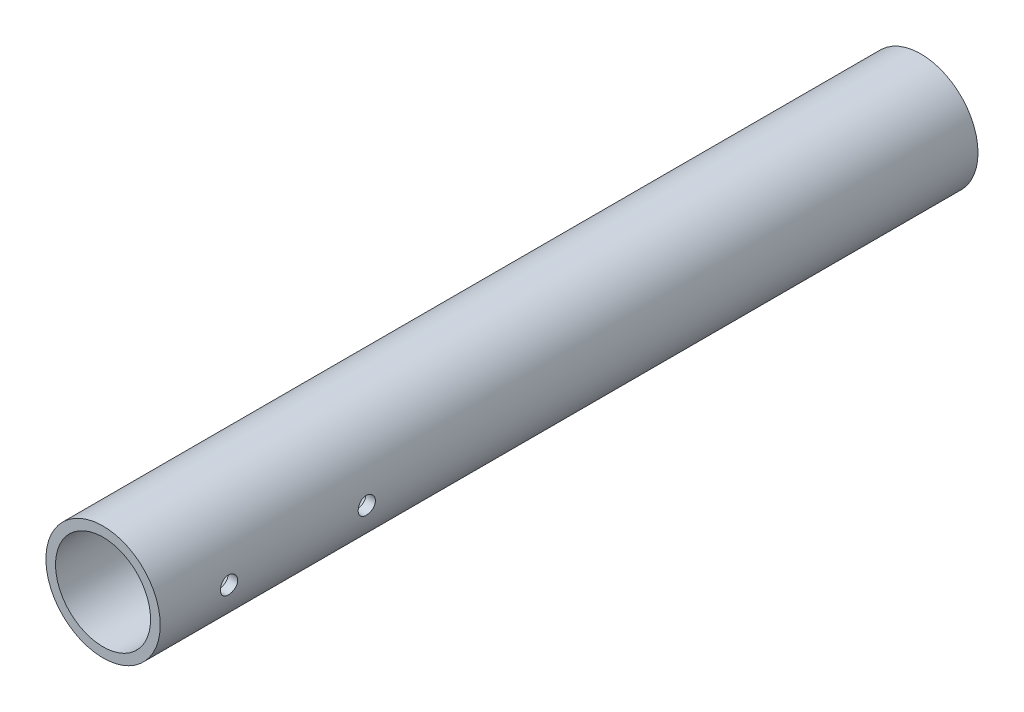
ISO-10303-21;
HEADER;
FILE_DESCRIPTION(('STEP AP214'),'2;1');
FILE_NAME('part.step','',(''),(''),'','','');
FILE_SCHEMA(('AUTOMOTIVE_DESIGN { 1 0 10303 214 1 1 1 1 }'));
ENDSEC;
DATA;
#1=APPLICATION_CONTEXT('core data for automotive mechanical design processes');
#2=APPLICATION_PROTOCOL_DEFINITION('international standard','automotive_design',2000,#1);
#3=PRODUCT_CONTEXT('',#1,'mechanical');
#4=PRODUCT('Part','Part','',(#3));
#5=PRODUCT_RELATED_PRODUCT_CATEGORY('part','',(#4));
#6=PRODUCT_DEFINITION_FORMATION('','',#4);
#7=PRODUCT_DEFINITION_CONTEXT('part definition',#1,'design');
#8=PRODUCT_DEFINITION('design','',#6,#7);
#9=PRODUCT_DEFINITION_SHAPE('','',#8);
#10=(LENGTH_UNIT() NAMED_UNIT(*) SI_UNIT(.MILLI.,.METRE.));
#11=(NAMED_UNIT(*) PLANE_ANGLE_UNIT() SI_UNIT($,.RADIAN.));
#12=(NAMED_UNIT(*) SI_UNIT($,.STERADIAN.) SOLID_ANGLE_UNIT());
#13=UNCERTAINTY_MEASURE_WITH_UNIT(LENGTH_MEASURE(1.E-05),#10,'distance_accuracy_value','');
#14=(GEOMETRIC_REPRESENTATION_CONTEXT(3) GLOBAL_UNCERTAINTY_ASSIGNED_CONTEXT((#13)) GLOBAL_UNIT_ASSIGNED_CONTEXT((#10,
#11,#12)) REPRESENTATION_CONTEXT('',''));
#15=CARTESIAN_POINT('',(0.,0.,0.));
#16=DIRECTION('',(0.,0.,1.));
#17=DIRECTION('',(1.,0.,0.));
#18=AXIS2_PLACEMENT_3D('',#15,#16,#17);
#19=CARTESIAN_POINT('',(0.,0.,0.));
#20=DIRECTION('',(0.,0.,1.));
#21=DIRECTION('',(1.,0.,0.));
#22=AXIS2_PLACEMENT_3D('',#19,#20,#21);
#23=CYLINDRICAL_SURFACE('',#22,17.526);
#24=CARTESIAN_POINT('',(0.,0.,301.625));
#25=DIRECTION('',(0.,0.,1.));
#26=DIRECTION('',(1.,0.,0.));
#27=AXIS2_PLACEMENT_3D('',#24,#25,#26);
#28=CIRCLE('',#27,17.526);
#29=CARTESIAN_POINT('',(17.526,0.,301.625));
#30=VERTEX_POINT('',#29);
#31=EDGE_CURVE('E18',#30,#30,#28,.F.);
#32=ORIENTED_EDGE('',*,*,#31,.F.);
#33=EDGE_LOOP('',(#32));
#34=FACE_BOUND('',#33,.T.);
#35=CARTESIAN_POINT('',(0.,0.,0.));
#36=DIRECTION('',(0.,0.,1.));
#37=DIRECTION('',(1.,0.,0.));
#38=AXIS2_PLACEMENT_3D('',#35,#36,#37);
#39=CIRCLE('',#38,17.526);
#40=CARTESIAN_POINT('',(17.526,0.,0.));
#41=VERTEX_POINT('',#40);
#42=EDGE_CURVE('E78',#41,#41,#39,.F.);
#43=ORIENTED_EDGE('',*,*,#42,.T.);
#44=EDGE_LOOP('',(#43));
#45=FACE_BOUND('',#44,.T.);
#46=CARTESIAN_POINT('',(17.526,0.,228.6));
#47=CARTESIAN_POINT('',(17.5259963175726,-0.176613181051219,228.599991723302));
#48=CARTESIAN_POINT('',(17.5233002826582,-0.353449171258822,228.585200668148));
#49=CARTESIAN_POINT('',(17.5127973362593,-0.702281908474058,228.526423100833));
#50=CARTESIAN_POINT('',(17.5049801575711,-0.874268208471729,228.482377935658));
#51=CARTESIAN_POINT('',(17.48511038614,-1.20810250721724,228.36647464681));
#52=CARTESIAN_POINT('',(17.473063368271,-1.36996352173553,228.294653119444));
#53=CARTESIAN_POINT('',(17.4460554580361,-1.67927316437238,228.125324943954));
#54=CARTESIAN_POINT('',(17.4310956012814,-1.82672688686375,228.027827420172));
#55=CARTESIAN_POINT('',(17.3997238299546,-2.10477719057218,227.808732397024));
#56=CARTESIAN_POINT('',(17.3832987194985,-2.23518750324315,227.686900352404));
#57=CARTESIAN_POINT('',(17.3509459564745,-2.4738411468331,227.42309368207));
#58=CARTESIAN_POINT('',(17.335018364459,-2.58208178835294,227.281116616098));
#59=CARTESIAN_POINT('',(17.3053385875312,-2.77407123838613,226.979766903282));
#60=CARTESIAN_POINT('',(17.2916032051447,-2.85763469507356,226.820274368621));
#61=CARTESIAN_POINT('',(17.2680458993697,-2.99671051245856,226.489226026226));
#62=CARTESIAN_POINT('',(17.2582236283197,-3.05222536525873,226.317671291755));
#63=CARTESIAN_POINT('',(17.2437354897132,-3.13304106760211,225.969333560972));
#64=CARTESIAN_POINT('',(17.2390149777777,-3.15866234519934,225.792627222411));
#65=CARTESIAN_POINT('',(17.2350999262051,-3.17995782709564,225.437365293601));
#66=CARTESIAN_POINT('',(17.2359049331653,-3.17563448853508,225.258809856282));
#67=CARTESIAN_POINT('',(17.2429001543548,-3.1374237379337,224.907230746528));
#68=CARTESIAN_POINT('',(17.2490242048828,-3.10389954139064,224.734166088615));
#69=CARTESIAN_POINT('',(17.2658637551246,-3.00880960849843,224.396157532169));
#70=CARTESIAN_POINT('',(17.276579474651,-2.94724252966899,224.231214022834));
#71=CARTESIAN_POINT('',(17.3014652665684,-2.79745291276664,223.913055892979));
#72=CARTESIAN_POINT('',(17.3156545368537,-2.70908155858375,223.759912899375));
#73=CARTESIAN_POINT('',(17.3458743890737,-2.50830442996258,223.470503775616));
#74=CARTESIAN_POINT('',(17.3619050065012,-2.39589819220294,223.334237970883));
#75=CARTESIAN_POINT('',(17.3942883351767,-2.1482992811474,223.080361728415));
#76=CARTESIAN_POINT('',(17.4106423451863,-2.01279967929527,222.963050627084));
#77=CARTESIAN_POINT('',(17.4416233292778,-1.72381393754222,222.752729015706));
#78=CARTESIAN_POINT('',(17.4562495353168,-1.57031985869495,222.65972929043));
#79=CARTESIAN_POINT('',(17.4821550853628,-1.24935860544025,222.50063859958));
#80=CARTESIAN_POINT('',(17.4934280108005,-1.08186540977742,222.434599150311));
#81=CARTESIAN_POINT('',(17.5112904348231,-0.738132155126084,222.331807400917));
#82=CARTESIAN_POINT('',(17.5178897862262,-0.561911340494511,222.294993467668));
#83=CARTESIAN_POINT('',(17.5231896350432,-0.320322833927912,222.265545032544));
#84=CARTESIAN_POINT('',(17.5242412276541,-0.256410066392401,222.259720466382));
#85=CARTESIAN_POINT('',(17.5256470796399,-0.128341342038199,222.251946444097));
#86=CARTESIAN_POINT('',(17.5260013382808,-0.0641853849635993,222.249996992053));
#87=CARTESIAN_POINT('',(17.5259963175725,0.176613181051216,222.250008276698));
#88=CARTESIAN_POINT('',(17.5233002826582,0.35344917125882,222.264799331852));
#89=CARTESIAN_POINT('',(17.5127973362593,0.702281908474057,222.323576899167));
#90=CARTESIAN_POINT('',(17.5049801575711,0.874268208471726,222.367622064342));
#91=CARTESIAN_POINT('',(17.48511038614,1.20810250721724,222.48352535319));
#92=CARTESIAN_POINT('',(17.473063368271,1.36996352173553,222.555346880556));
#93=CARTESIAN_POINT('',(17.4460554580361,1.67927316437238,222.724675056046));
#94=CARTESIAN_POINT('',(17.4310956012814,1.82672688686375,222.822172579828));
#95=CARTESIAN_POINT('',(17.3997238299546,2.10477719057218,223.041267602976));
#96=CARTESIAN_POINT('',(17.3832987194985,2.23518750324315,223.163099647596));
#97=CARTESIAN_POINT('',(17.3509459564745,2.4738411468331,223.42690631793));
#98=CARTESIAN_POINT('',(17.335018364459,2.58208178835294,223.568883383902));
#99=CARTESIAN_POINT('',(17.3053385875312,2.77407123838613,223.870233096717));
#100=CARTESIAN_POINT('',(17.2916032051447,2.85763469507356,224.029725631379));
#101=CARTESIAN_POINT('',(17.2680458993697,2.99671051245856,224.360773973774));
#102=CARTESIAN_POINT('',(17.2582236283197,3.05222536525873,224.532328708245));
#103=CARTESIAN_POINT('',(17.2437354897132,3.13304106760212,224.880666439028));
#104=CARTESIAN_POINT('',(17.2390149777777,3.15866234519934,225.057372777589));
#105=CARTESIAN_POINT('',(17.2350999262051,3.17995782709564,225.412634706399));
#106=CARTESIAN_POINT('',(17.2359049331653,3.17563448853508,225.591190143718));
#107=CARTESIAN_POINT('',(17.2429001543548,3.1374237379337,225.942769253472));
#108=CARTESIAN_POINT('',(17.2490242048828,3.10389954139064,226.115833911385));
#109=CARTESIAN_POINT('',(17.2658637551246,3.00880960849843,226.453842467831));
#110=CARTESIAN_POINT('',(17.276579474651,2.94724252966899,226.618785977166));
#111=CARTESIAN_POINT('',(17.3014652665683,2.79745291276665,226.936944107021));
#112=CARTESIAN_POINT('',(17.3156545368537,2.70908155858377,227.090087100625));
#113=CARTESIAN_POINT('',(17.3458743890737,2.50830442996262,227.379496224384));
#114=CARTESIAN_POINT('',(17.3619050065012,2.39589819220297,227.515762029117));
#115=CARTESIAN_POINT('',(17.3942883351767,2.14829928114741,227.769638271585));
#116=CARTESIAN_POINT('',(17.4106423451863,2.01279967929527,227.886949372916));
#117=CARTESIAN_POINT('',(17.4416233292778,1.72381393754221,228.097270984294));
#118=CARTESIAN_POINT('',(17.4562495353168,1.57031985869494,228.19027070957));
#119=CARTESIAN_POINT('',(17.4821550853628,1.24935860544024,228.34936140042));
#120=CARTESIAN_POINT('',(17.4934280108005,1.08186540977741,228.415400849689));
#121=CARTESIAN_POINT('',(17.5112904348231,0.738132155126082,228.518192599083));
#122=CARTESIAN_POINT('',(17.5178897862262,0.56191134049451,228.555006532332));
#123=CARTESIAN_POINT('',(17.5231896350432,0.320322833927913,228.584454967456));
#124=CARTESIAN_POINT('',(17.5242412276541,0.256410066392403,228.590279533618));
#125=CARTESIAN_POINT('',(17.5256470796399,0.128341342038199,228.598053555903));
#126=CARTESIAN_POINT('',(17.5260013382808,0.064185384963597,228.600003007947));
#127=CARTESIAN_POINT('',(17.526,0.,228.6));
#128=B_SPLINE_CURVE_WITH_KNOTS('',3,(#46,#47,#48,#49,#50,#51,#52,#53,#54,#55,#56,#57,#58,#59,
#60,#61,#62,#63,#64,#65,#66,#67,#68,#69,#70,#71,#72,#73,#74,#75,#76,#77,#78,#79,#80,#81,#82,#83,
#84,#85,#86,#87,#88,#89,#90,#91,#92,#93,#94,#95,#96,#97,#98,#99,#100,#101,#102,#103,#104,#105,
#106,#107,#108,#109,#110,#111,#112,#113,#114,#115,#116,#117,#118,#119,#120,#121,#122,#123,#124,
#125,#126,#127),.UNSPECIFIED.,.T.,.F.,(4,2,2,2,2,2,2,2,2,2,2,2,2,2,2,2,2,2,2,2,2,2,2,2,2,2,2,2,
2,2,2,2,2,2,2,2,2,2,2,2,4),(0.,0.529594384353563,1.06025379692028,1.59021641642846,
2.11999095947089,2.65514211392808,3.19035814908344,3.72949754433928,4.26858902893713,
4.80184732449043,5.33506186343175,5.86173721299806,6.38843777843187,6.91811781643,
7.44780806601112,7.98518312810166,8.52279617220151,9.06143174460419,9.59892835876538,
9.79139521459188,9.98386227300716,10.5134566573607,11.0441160699274,11.5740786894356,
12.103853232478,12.6390043869352,13.1742204220906,13.7133598173464,14.2524513019443,
14.7857095974976,15.3189241364389,15.8455994860052,16.372300051439,16.9019800894371,
17.4316703390183,17.9690454011088,18.5066584452087,19.0452940176114,19.5827906317725,
19.775257487599,19.9677245460143),.UNSPECIFIED.);
#129=CARTESIAN_POINT('',(17.526,0.,228.6));
#130=VERTEX_POINT('',#129);
#131=EDGE_CURVE('E72',#130,#130,#128,.T.);
#132=ORIENTED_EDGE('',*,*,#131,.T.);
#133=EDGE_LOOP('',(#132));
#134=FACE_BOUND('',#133,.T.);
#135=CARTESIAN_POINT('',(17.526,0.,279.4));
#136=CARTESIAN_POINT('',(17.5259963175726,-0.176613181051217,279.399991723302));
#137=CARTESIAN_POINT('',(17.5233002826582,-0.353449171258817,279.385200668148));
#138=CARTESIAN_POINT('',(17.5127973362593,-0.702281908474051,279.326423100833));
#139=CARTESIAN_POINT('',(17.5049801575711,-0.874268208471723,279.282377935658));
#140=CARTESIAN_POINT('',(17.48511038614,-1.20810250721723,279.16647464681));
#141=CARTESIAN_POINT('',(17.473063368271,-1.36996352173552,279.094653119444));
#142=CARTESIAN_POINT('',(17.4460554580361,-1.67927316437237,278.925324943954));
#143=CARTESIAN_POINT('',(17.4310956012814,-1.82672688686375,278.827827420172));
#144=CARTESIAN_POINT('',(17.3997238299546,-2.10477719057218,278.608732397024));
#145=CARTESIAN_POINT('',(17.3832987194985,-2.23518750324315,278.486900352404));
#146=CARTESIAN_POINT('',(17.3509459564745,-2.4738411468331,278.22309368207));
#147=CARTESIAN_POINT('',(17.335018364459,-2.58208178835293,278.081116616098));
#148=CARTESIAN_POINT('',(17.3053385875312,-2.77407123838613,277.779766903283));
#149=CARTESIAN_POINT('',(17.2916032051447,-2.85763469507356,277.620274368621));
#150=CARTESIAN_POINT('',(17.2680458993697,-2.99671051245855,277.289226026226));
#151=CARTESIAN_POINT('',(17.2582236283197,-3.05222536525872,277.117671291755));
#152=CARTESIAN_POINT('',(17.2437354897132,-3.13304106760211,276.769333560972));
#153=CARTESIAN_POINT('',(17.2390149777777,-3.15866234519934,276.592627222411));
#154=CARTESIAN_POINT('',(17.2350999262051,-3.17995782709565,276.237365293601));
#155=CARTESIAN_POINT('',(17.2359049331653,-3.17563448853508,276.058809856282));
#156=CARTESIAN_POINT('',(17.2429001543548,-3.13742373793371,275.707230746528));
#157=CARTESIAN_POINT('',(17.2490242048828,-3.10389954139064,275.534166088615));
#158=CARTESIAN_POINT('',(17.2658637551246,-3.00880960849844,275.196157532169));
#159=CARTESIAN_POINT('',(17.276579474651,-2.947242529669,275.031214022834));
#160=CARTESIAN_POINT('',(17.3014652665683,-2.79745291276668,274.713055892979));
#161=CARTESIAN_POINT('',(17.3156545368537,-2.70908155858381,274.559912899375));
#162=CARTESIAN_POINT('',(17.3458743890737,-2.50830442996264,274.270503775616));
#163=CARTESIAN_POINT('',(17.3619050065012,-2.39589819220297,274.134237970883));
#164=CARTESIAN_POINT('',(17.3942883351767,-2.14829928114741,273.880361728415));
#165=CARTESIAN_POINT('',(17.4106423451863,-2.01279967929529,273.763050627084));
#166=CARTESIAN_POINT('',(17.4416233292778,-1.72381393754225,273.552729015706));
#167=CARTESIAN_POINT('',(17.4562495353167,-1.57031985869497,273.45972929043));
#168=CARTESIAN_POINT('',(17.4821550853627,-1.24935860544027,273.30063859958));
#169=CARTESIAN_POINT('',(17.4934280108005,-1.08186540977745,273.234599150311));
#170=CARTESIAN_POINT('',(17.5112904348231,-0.738132155126105,273.131807400917));
#171=CARTESIAN_POINT('',(17.5178897862262,-0.561911340494518,273.094993467668));
#172=CARTESIAN_POINT('',(17.5231896350432,-0.320322833927917,273.065545032544));
#173=CARTESIAN_POINT('',(17.5242412276541,-0.256410066392408,273.059720466382));
#174=CARTESIAN_POINT('',(17.5256470796399,-0.128341342038205,273.051946444097));
#175=CARTESIAN_POINT('',(17.5260013382808,-0.0641853849636042,273.049996992053));
#176=CARTESIAN_POINT('',(17.5259963175725,0.176613181051215,273.050008276698));
#177=CARTESIAN_POINT('',(17.5233002826582,0.353449171258822,273.064799331852));
#178=CARTESIAN_POINT('',(17.5127973362593,0.702281908474058,273.123576899167));
#179=CARTESIAN_POINT('',(17.5049801575711,0.874268208471724,273.167622064342));
#180=CARTESIAN_POINT('',(17.48511038614,1.20810250721723,273.28352535319));
#181=CARTESIAN_POINT('',(17.473063368271,1.36996352173552,273.355346880556));
#182=CARTESIAN_POINT('',(17.4460554580361,1.67927316437237,273.524675056046));
#183=CARTESIAN_POINT('',(17.4310956012814,1.82672688686375,273.622172579828));
#184=CARTESIAN_POINT('',(17.3997238299546,2.10477719057218,273.841267602976));
#185=CARTESIAN_POINT('',(17.3832987194985,2.23518750324315,273.963099647596));
#186=CARTESIAN_POINT('',(17.3509459564745,2.4738411468331,274.22690631793));
#187=CARTESIAN_POINT('',(17.335018364459,2.58208178835293,274.368883383902));
#188=CARTESIAN_POINT('',(17.3053385875312,2.77407123838613,274.670233096717));
#189=CARTESIAN_POINT('',(17.2916032051447,2.85763469507356,274.829725631379));
#190=CARTESIAN_POINT('',(17.2680458993697,2.99671051245855,275.160773973774));
#191=CARTESIAN_POINT('',(17.2582236283197,3.05222536525872,275.332328708245));
#192=CARTESIAN_POINT('',(17.2437354897132,3.13304106760211,275.680666439028));
#193=CARTESIAN_POINT('',(17.2390149777777,3.15866234519934,275.857372777589));
#194=CARTESIAN_POINT('',(17.2350999262051,3.17995782709565,276.212634706399));
#195=CARTESIAN_POINT('',(17.2359049331653,3.17563448853508,276.391190143718));
#196=CARTESIAN_POINT('',(17.2429001543548,3.13742373793371,276.742769253472));
#197=CARTESIAN_POINT('',(17.2490242048828,3.10389954139064,276.915833911385));
#198=CARTESIAN_POINT('',(17.2658637551246,3.00880960849844,277.253842467831));
#199=CARTESIAN_POINT('',(17.276579474651,2.947242529669,277.418785977166));
#200=CARTESIAN_POINT('',(17.3014652665683,2.79745291276668,277.736944107021));
#201=CARTESIAN_POINT('',(17.3156545368537,2.70908155858381,277.890087100625));
#202=CARTESIAN_POINT('',(17.3458743890737,2.50830442996264,278.179496224384));
#203=CARTESIAN_POINT('',(17.3619050065012,2.39589819220297,278.315762029117));
#204=CARTESIAN_POINT('',(17.3942883351767,2.14829928114741,278.569638271585));
#205=CARTESIAN_POINT('',(17.4106423451863,2.01279967929529,278.686949372916));
#206=CARTESIAN_POINT('',(17.4416233292778,1.72381393754225,278.897270984294));
#207=CARTESIAN_POINT('',(17.4562495353167,1.57031985869498,278.99027070957));
#208=CARTESIAN_POINT('',(17.4821550853627,1.24935860544028,279.14936140042));
#209=CARTESIAN_POINT('',(17.4934280108005,1.08186540977744,279.215400849689));
#210=CARTESIAN_POINT('',(17.5112904348231,0.738132155126103,279.318192599083));
#211=CARTESIAN_POINT('',(17.5178897862262,0.561911340494523,279.355006532332));
#212=CARTESIAN_POINT('',(17.5231896350432,0.320322833927918,279.384454967456));
#213=CARTESIAN_POINT('',(17.5242412276541,0.256410066392406,279.390279533618));
#214=CARTESIAN_POINT('',(17.5256470796399,0.1283413420382,279.398053555903));
#215=CARTESIAN_POINT('',(17.5260013382808,0.0641853849635972,279.400003007947));
#216=CARTESIAN_POINT('',(17.526,0.,279.4));
#217=B_SPLINE_CURVE_WITH_KNOTS('',3,(#135,#136,#137,#138,#139,#140,#141,#142,#143,#144,#145,
#146,#147,#148,#149,#150,#151,#152,#153,#154,#155,#156,#157,#158,#159,#160,#161,#162,#163,#164,
#165,#166,#167,#168,#169,#170,#171,#172,#173,#174,#175,#176,#177,#178,#179,#180,#181,#182,#183,
#184,#185,#186,#187,#188,#189,#190,#191,#192,#193,#194,#195,#196,#197,#198,#199,#200,#201,#202,
#203,#204,#205,#206,#207,#208,#209,#210,#211,#212,#213,#214,#215,#216),.UNSPECIFIED.,.T.,.F.,(4,
2,2,2,2,2,2,2,2,2,2,2,2,2,2,2,2,2,2,2,2,2,2,2,2,2,2,2,2,2,2,2,2,2,2,2,2,2,2,2,4),(0.,
0.529594384353553,1.06025379692027,1.59021641642847,2.11999095947089,2.6551421139281,
3.19035814908337,3.72949754433927,4.26858902893715,4.80184732449042,5.33506186343168,
5.86173721299802,6.38843777843179,6.91811781642991,7.44780806601106,7.98518312810164,
8.52279617220147,9.06143174460417,9.59892835876537,9.79139521459187,9.98386227300715,
10.5134566573607,11.0441160699274,11.5740786894356,12.103853232478,12.6390043869353,
13.1742204220905,13.7133598173464,14.2524513019443,14.7857095974976,15.3189241364388,
15.8455994860052,16.372300051439,16.9019800894371,17.4316703390182,17.9690454011088,
18.5066584452086,19.0452940176113,19.5827906317725,19.775257487599,19.9677245460143),.UNSPECIFIED.);
#218=CARTESIAN_POINT('',(17.526,0.,279.4));
#219=VERTEX_POINT('',#218);
#220=EDGE_CURVE('E77',#219,#219,#217,.T.);
#221=ORIENTED_EDGE('',*,*,#220,.T.);
#222=EDGE_LOOP('',(#221));
#223=FACE_BOUND('',#222,.T.);
#224=ADVANCED_FACE('F14',(#34,#45,#134,#223),#23,.F.);
#225=CARTESIAN_POINT('',(0.,0.,301.625));
#226=DIRECTION('',(0.,0.,1.));
#227=DIRECTION('',(1.,0.,0.));
#228=AXIS2_PLACEMENT_3D('',#225,#226,#227);
#229=PLANE('',#228);
#230=ORIENTED_EDGE('',*,*,#31,.T.);
#231=EDGE_LOOP('',(#230));
#232=FACE_BOUND('',#231,.T.);
#233=CARTESIAN_POINT('',(0.,0.,301.625));
#234=DIRECTION('',(0.,0.,1.));
#235=DIRECTION('',(1.,0.,0.));
#236=AXIS2_PLACEMENT_3D('',#233,#234,#235);
#237=CIRCLE('',#236,21.082);
#238=CARTESIAN_POINT('',(21.082,0.,301.625));
#239=VERTEX_POINT('',#238);
#240=EDGE_CURVE('E53',#239,#239,#237,.F.);
#241=ORIENTED_EDGE('',*,*,#240,.F.);
#242=EDGE_LOOP('',(#241));
#243=FACE_BOUND('',#242,.T.);
#244=ADVANCED_FACE('F65',(#232,#243),#229,.T.);
#245=CARTESIAN_POINT('',(0.,0.,0.));
#246=DIRECTION('',(0.,0.,1.));
#247=DIRECTION('',(1.,0.,0.));
#248=AXIS2_PLACEMENT_3D('',#245,#246,#247);
#249=PLANE('',#248);
#250=ORIENTED_EDGE('',*,*,#42,.F.);
#251=EDGE_LOOP('',(#250));
#252=FACE_BOUND('',#251,.T.);
#253=CARTESIAN_POINT('',(0.,0.,0.));
#254=DIRECTION('',(0.,0.,1.));
#255=DIRECTION('',(1.,0.,0.));
#256=AXIS2_PLACEMENT_3D('',#253,#254,#255);
#257=CIRCLE('',#256,21.082);
#258=CARTESIAN_POINT('',(21.082,0.,0.));
#259=VERTEX_POINT('',#258);
#260=EDGE_CURVE('E27',#259,#259,#257,.T.);
#261=ORIENTED_EDGE('',*,*,#260,.F.);
#262=EDGE_LOOP('',(#261));
#263=FACE_BOUND('',#262,.T.);
#264=ADVANCED_FACE('F60',(#252,#263),#249,.F.);
#265=CARTESIAN_POINT('',(0.,0.,225.425));
#266=DIRECTION('',(1.,0.,0.));
#267=DIRECTION('',(0.,0.,-1.));
#268=AXIS2_PLACEMENT_3D('',#265,#266,#267);
#269=CYLINDRICAL_SURFACE('',#268,3.175);
#270=ORIENTED_EDGE('',*,*,#131,.F.);
#271=EDGE_LOOP('',(#270));
#272=FACE_BOUND('',#271,.T.);
#273=CARTESIAN_POINT('',(21.082,0.,222.25));
#274=CARTESIAN_POINT('',(21.08199697693,-0.177096882326681,222.250008010368));
#275=CARTESIAN_POINT('',(21.0797432371457,-0.354422246181486,222.26487962863));
#276=CARTESIAN_POINT('',(21.0709639947796,-0.704244999090061,222.323992357156));
#277=CARTESIAN_POINT('',(21.0644297330762,-0.876731730624422,222.368293691309));
#278=CARTESIAN_POINT('',(21.0478236267626,-1.21157212719879,222.484916576821));
#279=CARTESIAN_POINT('',(21.0377559284511,-1.37393740737855,222.557205296689));
#280=CARTESIAN_POINT('',(21.0151978427835,-1.68416250683157,222.727677911167));
#281=CARTESIAN_POINT('',(21.0027084021292,-1.83202796044268,222.825851692226));
#282=CARTESIAN_POINT('',(20.9765823177096,-2.11031247055376,223.046151374218));
#283=CARTESIAN_POINT('',(20.9629381187472,-2.24059940402081,223.168443308759));
#284=CARTESIAN_POINT('',(20.9360989041358,-2.4788913097797,223.43315612125));
#285=CARTESIAN_POINT('',(20.9229039374157,-2.58689386136821,223.57557918317));
#286=CARTESIAN_POINT('',(20.8983859370743,-2.77804880392724,223.877379318754));
#287=CARTESIAN_POINT('',(20.8870724896658,-2.86107558124535,224.03683680048));
#288=CARTESIAN_POINT('',(20.8676999734321,-2.99911832257812,224.367631067207));
#289=CARTESIAN_POINT('',(20.8596406975045,-3.05413606920678,224.538967095418));
#290=CARTESIAN_POINT('',(20.8477621063255,-3.13419546665349,224.887286214704));
#291=CARTESIAN_POINT('',(20.8439112642446,-3.15946012056009,225.064216954801));
#292=CARTESIAN_POINT('',(20.8407898414214,-3.17998700169885,225.419845640065));
#293=CARTESIAN_POINT('',(20.8415190033561,-3.17525091449293,225.598543485386));
#294=CARTESIAN_POINT('',(20.8474463650272,-3.13609305999255,225.951055967361));
#295=CARTESIAN_POINT('',(20.8526071214054,-3.10192000349508,226.124898951723));
#296=CARTESIAN_POINT('',(20.8667577563942,-3.00524711666564,226.464356569077));
#297=CARTESIAN_POINT('',(20.8757477764901,-2.94274623965999,226.62997089778));
#298=CARTESIAN_POINT('',(20.8965856584325,-2.79093104974241,226.949029881479));
#299=CARTESIAN_POINT('',(20.9084447970673,-2.70151058452644,227.102423259963));
#300=CARTESIAN_POINT('',(20.9336753486097,-2.49847766149162,227.392109939396));
#301=CARTESIAN_POINT('',(20.9470467424824,-2.3848655081586,227.528403455536));
#302=CARTESIAN_POINT('',(20.9739588701191,-2.13533197536228,227.781452795665));
#303=CARTESIAN_POINT('',(20.9874999699534,-1.99920089823695,227.89800187002));
#304=CARTESIAN_POINT('',(21.0131093792406,-1.70912894954015,228.106684321995));
#305=CARTESIAN_POINT('',(21.0251770223332,-1.55518008085437,228.198806674708));
#306=CARTESIAN_POINT('',(21.0464937025039,-1.23362225418931,228.356023003482));
#307=CARTESIAN_POINT('',(21.0557387492241,-1.06599437803163,228.421078761652));
#308=CARTESIAN_POINT('',(21.0703231912675,-0.722245530020102,228.521925293116));
#309=CARTESIAN_POINT('',(21.0756708320201,-0.546143333577576,228.557777868268));
#310=CARTESIAN_POINT('',(21.0798495375515,-0.307328662833132,228.585693304996));
#311=CARTESIAN_POINT('',(21.0806542771979,-0.245995981253088,228.591054107026));
#312=CARTESIAN_POINT('',(21.0817300341182,-0.12311807286592,228.598208848164));
#313=CARTESIAN_POINT('',(21.0820010510576,-0.0615728459255779,228.600002785036));
#314=CARTESIAN_POINT('',(21.08199697693,0.177096882326674,228.599991989632));
#315=CARTESIAN_POINT('',(21.0797432371457,0.354422246181477,228.58512037137));
#316=CARTESIAN_POINT('',(21.0709639947796,0.704244999090053,228.526007642844));
#317=CARTESIAN_POINT('',(21.0644297330762,0.876731730624415,228.481706308691));
#318=CARTESIAN_POINT('',(21.0478236267626,1.21157212719878,228.365083423179));
#319=CARTESIAN_POINT('',(21.0377559284511,1.37393740737854,228.292794703311));
#320=CARTESIAN_POINT('',(21.0151978427835,1.68416250683156,228.122322088833));
#321=CARTESIAN_POINT('',(21.0027084021292,1.83202796044268,228.024148307774));
#322=CARTESIAN_POINT('',(20.9765823177096,2.11031247055375,227.803848625782));
#323=CARTESIAN_POINT('',(20.9629381187472,2.2405994040208,227.681556691241));
#324=CARTESIAN_POINT('',(20.9360989041358,2.47889130977969,227.41684387875));
#325=CARTESIAN_POINT('',(20.9229039374157,2.5868938613682,227.27442081683));
#326=CARTESIAN_POINT('',(20.8983859370743,2.77804880392722,226.972620681246));
#327=CARTESIAN_POINT('',(20.8870724896658,2.86107558124534,226.81316319952));
#328=CARTESIAN_POINT('',(20.8676999734321,2.99911832257811,226.482368932793));
#329=CARTESIAN_POINT('',(20.8596406975045,3.05413606920678,226.311032904582));
#330=CARTESIAN_POINT('',(20.8477621063255,3.13419546665349,225.962713785296));
#331=CARTESIAN_POINT('',(20.8439112642446,3.15946012056009,225.785783045199));
#332=CARTESIAN_POINT('',(20.8407898414214,3.17998700169885,225.430154359935));
#333=CARTESIAN_POINT('',(20.8415190033561,3.17525091449293,225.251456514614));
#334=CARTESIAN_POINT('',(20.8474463650272,3.13609305999255,224.898944032639));
#335=CARTESIAN_POINT('',(20.8526071214054,3.10192000349508,224.725101048277));
#336=CARTESIAN_POINT('',(20.8667577563942,3.00524711666564,224.385643430923));
#337=CARTESIAN_POINT('',(20.8757477764901,2.94274623965999,224.22002910222));
#338=CARTESIAN_POINT('',(20.8965856584325,2.79093104974241,223.900970118521));
#339=CARTESIAN_POINT('',(20.9084447970673,2.70151058452644,223.747576740037));
#340=CARTESIAN_POINT('',(20.9336753486097,2.49847766149162,223.457890060604));
#341=CARTESIAN_POINT('',(20.9470467424824,2.3848655081586,223.321596544464));
#342=CARTESIAN_POINT('',(20.9739588701191,2.13533197536228,223.068547204335));
#343=CARTESIAN_POINT('',(20.9874999699534,1.99920089823695,222.95199812998));
#344=CARTESIAN_POINT('',(21.0131093792406,1.70912894954015,222.743315678005));
#345=CARTESIAN_POINT('',(21.0251770223332,1.55518008085437,222.651193325292));
#346=CARTESIAN_POINT('',(21.0464937025039,1.23362225418931,222.493976996518));
#347=CARTESIAN_POINT('',(21.0557387492241,1.06599437803164,222.428921238348));
#348=CARTESIAN_POINT('',(21.0703231912675,0.722245530020105,222.328074706884));
#349=CARTESIAN_POINT('',(21.0756708320201,0.546143333577579,222.292222131732));
#350=CARTESIAN_POINT('',(21.0798495375515,0.307328662833134,222.264306695004));
#351=CARTESIAN_POINT('',(21.0806542771979,0.245995981253089,222.258945892974));
#352=CARTESIAN_POINT('',(21.0817300341182,0.123118072865919,222.251791151836));
#353=CARTESIAN_POINT('',(21.0820010510576,0.0615728459255757,222.249997214964));
#354=CARTESIAN_POINT('',(21.082,0.,222.25));
#355=B_SPLINE_CURVE_WITH_KNOTS('',3,(#273,#274,#275,#276,#277,#278,#279,#280,#281,#282,#283,
#284,#285,#286,#287,#288,#289,#290,#291,#292,#293,#294,#295,#296,#297,#298,#299,#300,#301,#302,
#303,#304,#305,#306,#307,#308,#309,#310,#311,#312,#313,#314,#315,#316,#317,#318,#319,#320,#321,
#322,#323,#324,#325,#326,#327,#328,#329,#330,#331,#332,#333,#334,#335,#336,#337,#338,#339,#340,
#341,#342,#343,#344,#345,#346,#347,#348,#349,#350,#351,#352,#353,#354),.UNSPECIFIED.,.T.,.F.,(4,
2,2,2,2,2,2,2,2,2,2,2,2,2,2,2,2,2,2,2,2,2,2,2,2,2,2,2,2,2,2,2,2,2,2,2,2,2,2,2,4),(0.,
0.531055777943665,1.0632016503941,1.59472515452003,2.12604129410148,2.66115151001705,
3.19631982321002,3.73413637351617,4.27191869060599,4.80564407774994,5.33933947832749,
5.86856946465913,6.39781900689902,6.92918350732539,7.46054132019028,7.99715881916553,
8.53401810770141,9.07163288703761,9.60810694982832,9.79274371285329,9.97738059162621,
10.5084363695699,11.0405822420203,11.5721057461462,12.1034218857277,12.6385321016433,
13.1737004148362,13.7115169651423,14.2492992822322,14.7830246693762,15.3167200699537,
15.8459500562853,16.3751995985252,16.9065640989516,17.4379219118165,17.9745394107917,
18.5113986993276,19.0490134786638,19.5854875414545,19.7701243044795,19.9547611832524),.UNSPECIFIED.);
#356=CARTESIAN_POINT('',(21.082,0.,222.25));
#357=VERTEX_POINT('',#356);
#358=EDGE_CURVE('E22',#357,#357,#355,.T.);
#359=ORIENTED_EDGE('',*,*,#358,.F.);
#360=EDGE_LOOP('',(#359));
#361=FACE_BOUND('',#360,.T.);
#362=ADVANCED_FACE('F48',(#272,#361),#269,.F.);
#363=CARTESIAN_POINT('',(0.,0.,276.225));
#364=DIRECTION('',(1.,0.,0.));
#365=DIRECTION('',(0.,0.,-1.));
#366=AXIS2_PLACEMENT_3D('',#363,#364,#365);
#367=CYLINDRICAL_SURFACE('',#366,3.175);
#368=ORIENTED_EDGE('',*,*,#220,.F.);
#369=EDGE_LOOP('',(#368));
#370=FACE_BOUND('',#369,.T.);
#371=CARTESIAN_POINT('',(21.082,0.,273.05));
#372=CARTESIAN_POINT('',(21.08199697693,-0.17709688232668,273.050008010368));
#373=CARTESIAN_POINT('',(21.0797432371457,-0.354422246181484,273.06487962863));
#374=CARTESIAN_POINT('',(21.0709639947796,-0.704244999090057,273.123992357156));
#375=CARTESIAN_POINT('',(21.0644297330762,-0.876731730624416,273.168293691309));
#376=CARTESIAN_POINT('',(21.0478236267626,-1.21157212719878,273.284916576821));
#377=CARTESIAN_POINT('',(21.0377559284511,-1.37393740737854,273.357205296689));
#378=CARTESIAN_POINT('',(21.0151978427835,-1.68416250683155,273.527677911167));
#379=CARTESIAN_POINT('',(21.0027084021292,-1.83202796044267,273.625851692226));
#380=CARTESIAN_POINT('',(20.9765823177096,-2.11031247055373,273.846151374218));
#381=CARTESIAN_POINT('',(20.9629381187472,-2.24059940402077,273.968443308759));
#382=CARTESIAN_POINT('',(20.9360989041358,-2.47889130977967,274.23315612125));
#383=CARTESIAN_POINT('',(20.9229039374157,-2.58689386136818,274.37557918317));
#384=CARTESIAN_POINT('',(20.8983859370743,-2.77804880392722,274.677379318754));
#385=CARTESIAN_POINT('',(20.8870724896658,-2.86107558124533,274.83683680048));
#386=CARTESIAN_POINT('',(20.8676999734321,-2.99911832257811,275.167631067207));
#387=CARTESIAN_POINT('',(20.8596406975045,-3.05413606920677,275.338967095418));
#388=CARTESIAN_POINT('',(20.8477621063255,-3.13419546665348,275.687286214704));
#389=CARTESIAN_POINT('',(20.8439112642446,-3.15946012056009,275.864216954801));
#390=CARTESIAN_POINT('',(20.8407898414214,-3.17998700169885,276.219845640065));
#391=CARTESIAN_POINT('',(20.8415190033561,-3.17525091449293,276.398543485386));
#392=CARTESIAN_POINT('',(20.8474463650272,-3.13609305999255,276.751055967361));
#393=CARTESIAN_POINT('',(20.8526071214054,-3.10192000349509,276.924898951723));
#394=CARTESIAN_POINT('',(20.8667577563942,-3.00524711666565,277.264356569077));
#395=CARTESIAN_POINT('',(20.8757477764901,-2.94274623966,277.42997089778));
#396=CARTESIAN_POINT('',(20.8965856584325,-2.79093104974242,277.749029881479));
#397=CARTESIAN_POINT('',(20.9084447970673,-2.70151058452642,277.902423259963));
#398=CARTESIAN_POINT('',(20.9336753486097,-2.49847766149159,278.192109939396));
#399=CARTESIAN_POINT('',(20.9470467424824,-2.38486550815859,278.328403455536));
#400=CARTESIAN_POINT('',(20.9739588701191,-2.13533197536228,278.581452795665));
#401=CARTESIAN_POINT('',(20.9874999699534,-1.99920089823695,278.69800187002));
#402=CARTESIAN_POINT('',(21.0131093792406,-1.70912894954015,278.906684321995));
#403=CARTESIAN_POINT('',(21.0251770223332,-1.55518008085437,278.998806674708));
#404=CARTESIAN_POINT('',(21.0464937025039,-1.23362225418932,279.156023003482));
#405=CARTESIAN_POINT('',(21.0557387492241,-1.06599437803164,279.221078761652));
#406=CARTESIAN_POINT('',(21.0703231912675,-0.722245530020103,279.321925293116));
#407=CARTESIAN_POINT('',(21.0756708320201,-0.546143333577574,279.357777868268));
#408=CARTESIAN_POINT('',(21.0798495375515,-0.307328662833127,279.385693304996));
#409=CARTESIAN_POINT('',(21.0806542771979,-0.245995981253084,279.391054107026));
#410=CARTESIAN_POINT('',(21.0817300341182,-0.12311807286592,279.398208848164));
#411=CARTESIAN_POINT('',(21.0820010510576,-0.0615728459255789,279.400002785036));
#412=CARTESIAN_POINT('',(21.08199697693,0.177096882326675,279.399991989632));
#413=CARTESIAN_POINT('',(21.0797432371457,0.354422246181479,279.38512037137));
#414=CARTESIAN_POINT('',(21.0709639947796,0.704244999090053,279.326007642844));
#415=CARTESIAN_POINT('',(21.0644297330762,0.876731730624414,279.281706308691));
#416=CARTESIAN_POINT('',(21.0478236267626,1.21157212719877,279.165083423179));
#417=CARTESIAN_POINT('',(21.0377559284511,1.37393740737852,279.092794703311));
#418=CARTESIAN_POINT('',(21.0151978427835,1.68416250683153,278.922322088833));
#419=CARTESIAN_POINT('',(21.0027084021292,1.83202796044266,278.824148307773));
#420=CARTESIAN_POINT('',(20.9765823177096,2.11031247055373,278.603848625782));
#421=CARTESIAN_POINT('',(20.9629381187472,2.24059940402077,278.481556691241));
#422=CARTESIAN_POINT('',(20.9360989041358,2.47889130977966,278.21684387875));
#423=CARTESIAN_POINT('',(20.9229039374157,2.58689386136818,278.07442081683));
#424=CARTESIAN_POINT('',(20.8983859370743,2.77804880392721,277.772620681246));
#425=CARTESIAN_POINT('',(20.8870724896658,2.86107558124532,277.61316319952));
#426=CARTESIAN_POINT('',(20.8676999734321,2.9991183225781,277.282368932793));
#427=CARTESIAN_POINT('',(20.8596406975045,3.05413606920677,277.111032904582));
#428=CARTESIAN_POINT('',(20.8477621063255,3.13419546665348,276.762713785296));
#429=CARTESIAN_POINT('',(20.8439112642446,3.15946012056009,276.585783045199));
#430=CARTESIAN_POINT('',(20.8407898414214,3.17998700169885,276.230154359935));
#431=CARTESIAN_POINT('',(20.8415190033561,3.17525091449293,276.051456514614));
#432=CARTESIAN_POINT('',(20.8474463650272,3.13609305999255,275.698944032639));
#433=CARTESIAN_POINT('',(20.8526071214054,3.10192000349509,275.525101048277));
#434=CARTESIAN_POINT('',(20.8667577563942,3.00524711666566,275.185643430923));
#435=CARTESIAN_POINT('',(20.8757477764901,2.94274623966001,275.02002910222));
#436=CARTESIAN_POINT('',(20.8965856584325,2.79093104974243,274.700970118521));
#437=CARTESIAN_POINT('',(20.9084447970673,2.70151058452646,274.547576740037));
#438=CARTESIAN_POINT('',(20.9336753486097,2.49847766149166,274.257890060604));
#439=CARTESIAN_POINT('',(20.9470467424824,2.38486550815865,274.121596544464));
#440=CARTESIAN_POINT('',(20.9739588701191,2.13533197536231,273.868547204335));
#441=CARTESIAN_POINT('',(20.9874999699534,1.99920089823697,273.75199812998));
#442=CARTESIAN_POINT('',(21.0131093792406,1.70912894954014,273.543315678005));
#443=CARTESIAN_POINT('',(21.0251770223332,1.55518008085435,273.451193325292));
#444=CARTESIAN_POINT('',(21.0464937025039,1.23362225418928,273.293976996517));
#445=CARTESIAN_POINT('',(21.0557387492241,1.0659943780316,273.228921238348));
#446=CARTESIAN_POINT('',(21.0703231912676,0.722245530020078,273.128074706884));
#447=CARTESIAN_POINT('',(21.0756708320201,0.546143333577566,273.092222131732));
#448=CARTESIAN_POINT('',(21.0798495375515,0.307328662833132,273.064306695004));
#449=CARTESIAN_POINT('',(21.0806542771979,0.245995981253086,273.058945892974));
#450=CARTESIAN_POINT('',(21.0817300341182,0.123118072865918,273.051791151836));
#451=CARTESIAN_POINT('',(21.0820010510576,0.0615728459255751,273.049997214964));
#452=CARTESIAN_POINT('',(21.082,0.,273.05));
#453=B_SPLINE_CURVE_WITH_KNOTS('',3,(#371,#372,#373,#374,#375,#376,#377,#378,#379,#380,#381,
#382,#383,#384,#385,#386,#387,#388,#389,#390,#391,#392,#393,#394,#395,#396,#397,#398,#399,#400,
#401,#402,#403,#404,#405,#406,#407,#408,#409,#410,#411,#412,#413,#414,#415,#416,#417,#418,#419,
#420,#421,#422,#423,#424,#425,#426,#427,#428,#429,#430,#431,#432,#433,#434,#435,#436,#437,#438,
#439,#440,#441,#442,#443,#444,#445,#446,#447,#448,#449,#450,#451,#452),.UNSPECIFIED.,.T.,.F.,(4,
2,2,2,2,2,2,2,2,2,2,2,2,2,2,2,2,2,2,2,2,2,2,2,2,2,2,2,2,2,2,2,2,2,2,2,2,2,2,2,4),(0.,
0.53105577794366,1.06320165039409,1.59472515452001,2.12604129410146,2.66115151001699,
3.19631982320995,3.73413637351611,4.27191869060596,4.80564407774988,5.33933947832746,
5.86856946465915,6.39781900689901,6.9291835073254,7.46054132019028,7.99715881916551,
8.53401810770137,9.07163288703761,9.60810694982833,9.79274371285329,9.9773805916262,
10.5084363695699,11.0405822420203,11.5721057461462,12.1034218857277,12.6385321016432,
13.1737004148362,13.7115169651423,14.2492992822322,14.7830246693761,15.3167200699537,
15.8459500562853,16.3751995985252,16.9065640989515,17.4379219118164,17.9745394107917,
18.5113986993276,19.0490134786639,19.5854875414545,19.7701243044795,19.9547611832524),.UNSPECIFIED.);
#454=CARTESIAN_POINT('',(21.082,0.,273.05));
#455=VERTEX_POINT('',#454);
#456=EDGE_CURVE('E10',#455,#455,#453,.T.);
#457=ORIENTED_EDGE('',*,*,#456,.F.);
#458=EDGE_LOOP('',(#457));
#459=FACE_BOUND('',#458,.T.);
#460=ADVANCED_FACE('F37',(#370,#459),#367,.F.);
#461=CARTESIAN_POINT('',(0.,0.,0.));
#462=DIRECTION('',(0.,0.,1.));
#463=DIRECTION('',(1.,0.,0.));
#464=AXIS2_PLACEMENT_3D('',#461,#462,#463);
#465=CYLINDRICAL_SURFACE('',#464,21.082);
#466=ORIENTED_EDGE('',*,*,#240,.T.);
#467=EDGE_LOOP('',(#466));
#468=FACE_BOUND('',#467,.T.);
#469=ORIENTED_EDGE('',*,*,#260,.T.);
#470=EDGE_LOOP('',(#469));
#471=FACE_BOUND('',#470,.T.);
#472=ORIENTED_EDGE('',*,*,#358,.T.);
#473=EDGE_LOOP('',(#472));
#474=FACE_BOUND('',#473,.T.);
#475=ORIENTED_EDGE('',*,*,#456,.T.);
#476=EDGE_LOOP('',(#475));
#477=FACE_BOUND('',#476,.T.);
#478=ADVANCED_FACE('F39',(#468,#471,#474,#477),#465,.T.);
#479=CLOSED_SHELL('',(#224,#244,#264,#362,#460,#478));
#480=MANIFOLD_SOLID_BREP('B1',#479);
#481=ADVANCED_BREP_SHAPE_REPRESENTATION('',(#18,#480),#14);
#482=SHAPE_DEFINITION_REPRESENTATION(#9,#481);
ENDSEC;
END-ISO-10303-21;
